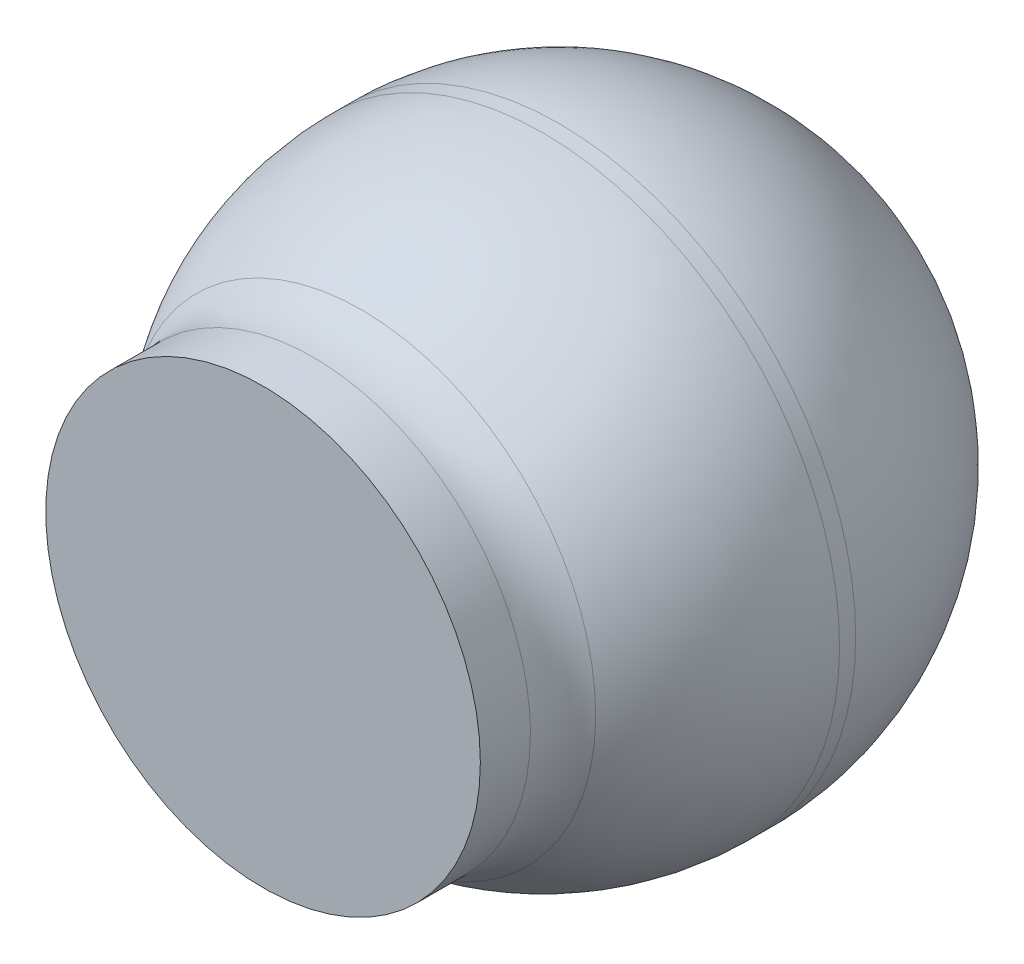
ISO-10303-21;
HEADER;
FILE_DESCRIPTION(('STEP AP214'),'2;1');
FILE_NAME('part.step','',(''),(''),'','','');
FILE_SCHEMA(('AUTOMOTIVE_DESIGN { 1 0 10303 214 1 1 1 1 }'));
ENDSEC;
DATA;
#1=APPLICATION_CONTEXT('core data for automotive mechanical design processes');
#2=APPLICATION_PROTOCOL_DEFINITION('international standard','automotive_design',2000,#1);
#3=PRODUCT_CONTEXT('',#1,'mechanical');
#4=PRODUCT('Part','Part','',(#3));
#5=PRODUCT_RELATED_PRODUCT_CATEGORY('part','',(#4));
#6=PRODUCT_DEFINITION_FORMATION('','',#4);
#7=PRODUCT_DEFINITION_CONTEXT('part definition',#1,'design');
#8=PRODUCT_DEFINITION('design','',#6,#7);
#9=PRODUCT_DEFINITION_SHAPE('','',#8);
#10=(LENGTH_UNIT() NAMED_UNIT(*) SI_UNIT(.MILLI.,.METRE.));
#11=(NAMED_UNIT(*) PLANE_ANGLE_UNIT() SI_UNIT($,.RADIAN.));
#12=(NAMED_UNIT(*) SI_UNIT($,.STERADIAN.) SOLID_ANGLE_UNIT());
#13=UNCERTAINTY_MEASURE_WITH_UNIT(LENGTH_MEASURE(1.E-05),#10,'distance_accuracy_value','');
#14=(GEOMETRIC_REPRESENTATION_CONTEXT(3) GLOBAL_UNCERTAINTY_ASSIGNED_CONTEXT((#13)) GLOBAL_UNIT_ASSIGNED_CONTEXT((#10,
#11,#12)) REPRESENTATION_CONTEXT('',''));
#15=CARTESIAN_POINT('',(0.,0.,0.));
#16=DIRECTION('',(0.,0.,1.));
#17=DIRECTION('',(1.,0.,0.));
#18=AXIS2_PLACEMENT_3D('',#15,#16,#17);
#19=CARTESIAN_POINT('',(-6.912919922269,-5.321349291452,10.006534503384));
#20=DIRECTION('',(0.,0.,-1.));
#21=DIRECTION('',(-1.,0.,0.));
#22=AXIS2_PLACEMENT_3D('',#19,#20,#21);
#23=PLANE('',#22);
#24=CARTESIAN_POINT('',(-6.912919922269,-5.321349291452,10.006534503384));
#25=DIRECTION('',(0.,0.,1.));
#26=DIRECTION('',(1.,0.,0.));
#27=AXIS2_PLACEMENT_3D('',#24,#25,#26);
#28=CIRCLE('',#27,0.275);
#29=CARTESIAN_POINT('',(-6.637919922269,-5.321349291452,10.006534503384));
#30=VERTEX_POINT('',#29);
#31=EDGE_CURVE('E20',#30,#30,#28,.F.);
#32=ORIENTED_EDGE('',*,*,#31,.F.);
#33=EDGE_LOOP('',(#32));
#34=FACE_BOUND('',#33,.T.);
#35=ADVANCED_FACE('F17',(#34),#23,.F.);
#36=CARTESIAN_POINT('',(-6.912919922269,-5.321349291452,9.906534503384));
#37=DIRECTION('',(0.,0.,1.));
#38=DIRECTION('',(1.,0.,0.));
#39=AXIS2_PLACEMENT_3D('',#36,#37,#38);
#40=CYLINDRICAL_SURFACE('',#39,0.275);
#41=CARTESIAN_POINT('',(-6.912919922269,-5.321349291452,9.943180457728));
#42=DIRECTION('',(0.,0.,-1.));
#43=DIRECTION('',(0.996700902337583,0.0811622527992439,0.));
#44=AXIS2_PLACEMENT_3D('',#41,#42,#43);
#45=CIRCLE('',#44,0.275);
#46=CARTESIAN_POINT('',(-6.63882717412617,-5.29902967193221,9.943180457728));
#47=VERTEX_POINT('',#46);
#48=EDGE_CURVE('E65',#47,#47,#45,.F.);
#49=ORIENTED_EDGE('',*,*,#48,.T.);
#50=EDGE_LOOP('',(#49));
#51=FACE_BOUND('',#50,.T.);
#52=ORIENTED_EDGE('',*,*,#31,.T.);
#53=EDGE_LOOP('',(#52));
#54=FACE_BOUND('',#53,.T.);
#55=ADVANCED_FACE('F62',(#51,#54),#40,.T.);
#56=CARTESIAN_POINT('',(-6.912919922269,-5.321349291452,9.943180457728));
#57=DIRECTION('',(0.,0.,-1.));
#58=DIRECTION('',(0.996700902337583,0.0811622527992448,0.));
#59=AXIS2_PLACEMENT_3D('',#56,#57,#58);
#60=TOROIDAL_SURFACE('',#59,0.375,0.1);
#61=ORIENTED_EDGE('',*,*,#48,.F.);
#62=EDGE_LOOP('',(#61));
#63=FACE_BOUND('',#62,.T.);
#64=CARTESIAN_POINT('',(-6.912919922269,-5.321349291452,9.881744931236));
#65=DIRECTION('',(0.,0.,-1.));
#66=DIRECTION('',(-0.996700902337598,-0.0811622527990622,0.));
#67=AXIS2_PLACEMENT_3D('',#64,#65,#66);
#68=CIRCLE('',#67,0.296097046412665);
#69=CARTESIAN_POINT('',(-7.208040115608,-5.345381194786,9.881744931236));
#70=VERTEX_POINT('',#69);
#71=EDGE_CURVE('E39',#70,#70,#68,.T.);
#72=ORIENTED_EDGE('',*,*,#71,.F.);
#73=EDGE_LOOP('',(#72));
#74=FACE_BOUND('',#73,.T.);
#75=ADVANCED_FACE('F57',(#63,#74),#60,.F.);
#76=CARTESIAN_POINT('',(-7.286682760645,-5.351785136252,9.651976062157));
#77=CARTESIAN_POINT('',(-7.286682760645,-5.351785136252,9.701461392103));
#78=CARTESIAN_POINT('',(-7.278526217348,-5.351120941579,9.750947004335));
#79=CARTESIAN_POINT('',(-7.262207085349,-5.349792059952,9.798626332798));
#80=CARTESIAN_POINT('',(-7.238341390838,-5.347848654938,9.842699544317));
#81=CARTESIAN_POINT('',(-7.208040115608,-5.345381194786,9.881744931236));
#82=(BOUNDED_CURVE() B_SPLINE_CURVE(5,(#76,#77,#78,#79,#80,#81),.UNSPECIFIED.,.F.,
.F.) B_SPLINE_CURVE_WITH_KNOTS((6,6),(0.,0.661568582165),
.UNSPECIFIED.) CURVE() GEOMETRIC_REPRESENTATION_ITEM() RATIONAL_B_SPLINE_CURVE((1.,1.,1.,1.,1.,1.)) REPRESENTATION_ITEM(''));
#83=CARTESIAN_POINT('',(-6.912919922269,-5.321349291452,9.651976062157));
#84=DIRECTION('',(0.,0.,-1.));
#85=AXIS1_PLACEMENT('',#83,#84);
#86=SURFACE_OF_REVOLUTION('',#82,#85);
#87=CARTESIAN_POINT('',(-6.912919922269,-5.321349291452,9.651976062157));
#88=DIRECTION('',(0.,0.,1.));
#89=DIRECTION('',(1.,0.,0.));
#90=AXIS2_PLACEMENT_3D('',#87,#88,#89);
#91=CIRCLE('',#90,0.375);
#92=CARTESIAN_POINT('',(-6.537919922269,-5.321349291452,9.651976062157));
#93=VERTEX_POINT('',#92);
#94=EDGE_CURVE('E36',#93,#93,#91,.F.);
#95=ORIENTED_EDGE('',*,*,#94,.F.);
#96=EDGE_LOOP('',(#95));
#97=FACE_BOUND('',#96,.T.);
#98=ORIENTED_EDGE('',*,*,#71,.T.);
#99=EDGE_LOOP('',(#98));
#100=FACE_BOUND('',#99,.T.);
#101=ADVANCED_FACE('F53',(#97,#100),#86,.F.);
#102=CARTESIAN_POINT('',(-6.912919922269,-5.321349291452,9.256534503384));
#103=DIRECTION('',(0.,0.,1.));
#104=DIRECTION('',(1.,0.,0.));
#105=AXIS2_PLACEMENT_3D('',#102,#103,#104);
#106=CYLINDRICAL_SURFACE('',#105,0.375);
#107=CARTESIAN_POINT('',(-6.912919922269,-5.321349291452,9.631534503384));
#108=DIRECTION('',(0.,0.,-1.));
#109=DIRECTION('',(0.0811622527992357,-0.996700902337583,0.));
#110=AXIS2_PLACEMENT_3D('',#107,#108,#109);
#111=CIRCLE('',#110,0.375);
#112=CARTESIAN_POINT('',(-6.88248407746929,-5.69511212982859,9.631534503384));
#113=VERTEX_POINT('',#112);
#114=CARTESIAN_POINT('',(-6.94335576706871,-4.94758645307541,9.631534503384));
#115=VERTEX_POINT('',#114);
#116=EDGE_CURVE('E11',#113,#115,#111,.T.);
#117=ORIENTED_EDGE('',*,*,#116,.F.);
#118=CARTESIAN_POINT('',(-6.912919922269,-5.321349291452,9.631534503384));
#119=DIRECTION('',(0.,0.,1.));
#120=DIRECTION('',(0.0811622527992365,-0.996700902337583,0.));
#121=AXIS2_PLACEMENT_3D('',#118,#119,#120);
#122=CIRCLE('',#121,0.375);
#123=EDGE_CURVE('E25',#115,#113,#122,.F.);
#124=ORIENTED_EDGE('',*,*,#123,.F.);
#125=EDGE_LOOP('',(#117,#124));
#126=FACE_BOUND('',#125,.T.);
#127=ORIENTED_EDGE('',*,*,#94,.T.);
#128=EDGE_LOOP('',(#127));
#129=FACE_BOUND('',#128,.T.);
#130=ADVANCED_FACE('F34',(#126,#129),#106,.T.);
#131=CARTESIAN_POINT('',(-6.912919922269,-5.321349291452,9.631534503384));
#132=DIRECTION('',(0.0811622527992361,-0.996700902337583,0.));
#133=DIRECTION('',(-0.996700902337583,-0.0811622527992361,0.));
#134=AXIS2_PLACEMENT_3D('',#131,#132,#133);
#135=SPHERICAL_SURFACE('',#134,0.375);
#136=ORIENTED_EDGE('',*,*,#123,.T.);
#137=ORIENTED_EDGE('',*,*,#116,.T.);
#138=EDGE_LOOP('',(#136,#137));
#139=FACE_BOUND('',#138,.T.);
#140=ADVANCED_FACE('F32',(#139),#135,.T.);
#141=CLOSED_SHELL('',(#35,#55,#75,#101,#130,#140));
#142=MANIFOLD_SOLID_BREP('B1',#141);
#143=ADVANCED_BREP_SHAPE_REPRESENTATION('',(#18,#142),#14);
#144=SHAPE_DEFINITION_REPRESENTATION(#9,#143);
ENDSEC;
END-ISO-10303-21;
